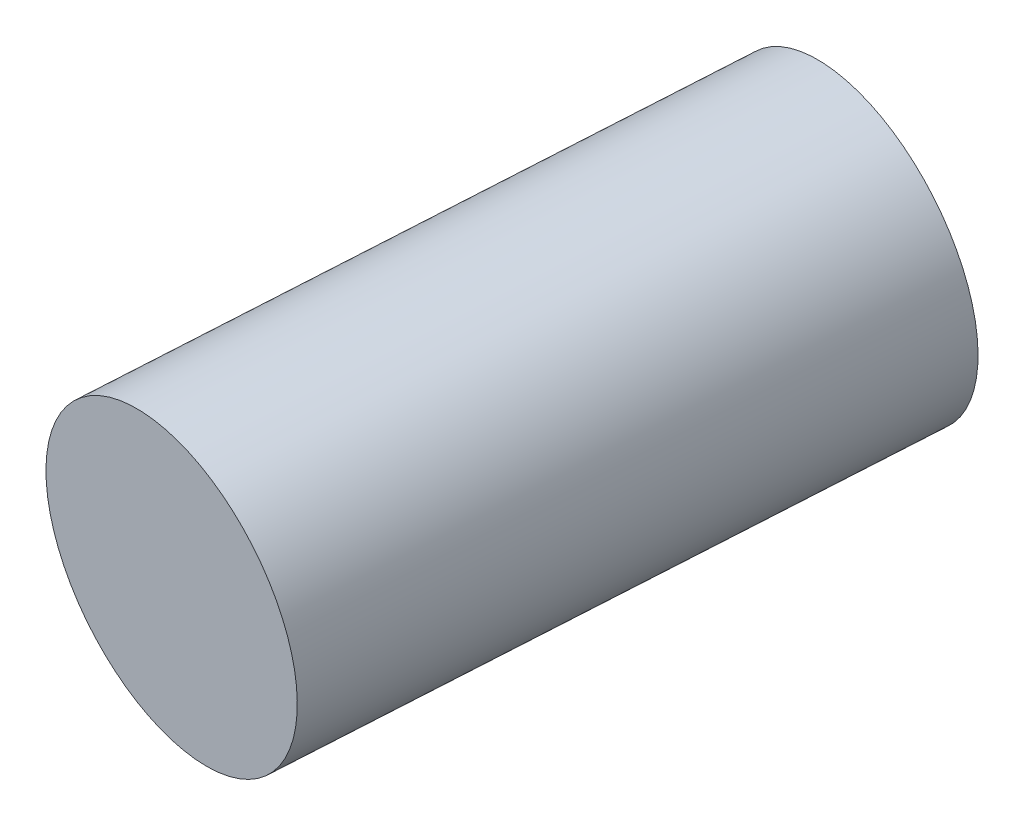
ISO-10303-21;
HEADER;
FILE_DESCRIPTION(('STEP AP214'),'2;1');
FILE_NAME('part.step','',(''),(''),'','','');
FILE_SCHEMA(('AUTOMOTIVE_DESIGN { 1 0 10303 214 1 1 1 1 }'));
ENDSEC;
DATA;
#1=APPLICATION_CONTEXT('core data for automotive mechanical design processes');
#2=APPLICATION_PROTOCOL_DEFINITION('international standard','automotive_design',2000,#1);
#3=PRODUCT_CONTEXT('',#1,'mechanical');
#4=PRODUCT('Part','Part','',(#3));
#5=PRODUCT_RELATED_PRODUCT_CATEGORY('part','',(#4));
#6=PRODUCT_DEFINITION_FORMATION('','',#4);
#7=PRODUCT_DEFINITION_CONTEXT('part definition',#1,'design');
#8=PRODUCT_DEFINITION('design','',#6,#7);
#9=PRODUCT_DEFINITION_SHAPE('','',#8);
#10=(LENGTH_UNIT() NAMED_UNIT(*) SI_UNIT(.MILLI.,.METRE.));
#11=(NAMED_UNIT(*) PLANE_ANGLE_UNIT() SI_UNIT($,.RADIAN.));
#12=(NAMED_UNIT(*) SI_UNIT($,.STERADIAN.) SOLID_ANGLE_UNIT());
#13=UNCERTAINTY_MEASURE_WITH_UNIT(LENGTH_MEASURE(1.E-05),#10,'distance_accuracy_value','');
#14=(GEOMETRIC_REPRESENTATION_CONTEXT(3) GLOBAL_UNCERTAINTY_ASSIGNED_CONTEXT((#13)) GLOBAL_UNIT_ASSIGNED_CONTEXT((#10,
#11,#12)) REPRESENTATION_CONTEXT('',''));
#15=CARTESIAN_POINT('',(0.,0.,0.));
#16=DIRECTION('',(0.,0.,1.));
#17=DIRECTION('',(1.,0.,0.));
#18=AXIS2_PLACEMENT_3D('',#15,#16,#17);
#19=CARTESIAN_POINT('',(9.46265533813226,5.46326660671928,5.55625000000001));
#20=DIRECTION('',(-0.150383733180433,-0.0868240888334634,0.984807753012209));
#21=DIRECTION('',(-0.852868531952445,-0.492403876506102,-0.173648177666927));
#22=AXIS2_PLACEMENT_3D('',#19,#20,#21);
#23=CYLINDRICAL_SURFACE('',#22,1.93220030269667);
#24=CARTESIAN_POINT('',(9.62646498755646,5.5578421519102,4.48352085995661));
#25=DIRECTION('',(-0.150383733180433,-0.0868240888334634,0.984807753012209));
#26=DIRECTION('',(-0.852868531952445,-0.492403876506102,-0.173648177666927));
#27=AXIS2_PLACEMENT_3D('',#24,#25,#26);
#28=CIRCLE('',#27,1.93220030269667);
#29=CARTESIAN_POINT('',(7.97855215195748,4.6064192326761,4.14799779850585));
#30=VERTEX_POINT('',#29);
#31=EDGE_CURVE('E22',#30,#30,#28,.T.);
#32=ORIENTED_EDGE('',*,*,#31,.F.);
#33=EDGE_LOOP('',(#32));
#34=FACE_BOUND('',#33,.T.);
#35=CARTESIAN_POINT('',(10.7959490356235,6.23304408187466,-3.175));
#36=DIRECTION('',(-0.150383733180433,-0.0868240888334634,0.984807753012209));
#37=DIRECTION('',(-0.852868531952445,-0.492403876506102,-0.173648177666927));
#38=AXIS2_PLACEMENT_3D('',#35,#36,#37);
#39=CIRCLE('',#38,1.93220030269668);
#40=CARTESIAN_POINT('',(9.14803620002451,5.28162116264055,-3.51052306145076));
#41=VERTEX_POINT('',#40);
#42=EDGE_CURVE('E10',#41,#41,#39,.T.);
#43=ORIENTED_EDGE('',*,*,#42,.T.);
#44=EDGE_LOOP('',(#43));
#45=FACE_BOUND('',#44,.T.);
#46=ADVANCED_FACE('F15',(#34,#45),#23,.T.);
#47=CARTESIAN_POINT('',(12.4438618712225,7.18446700110877,-2.83947693854923));
#48=DIRECTION('',(-0.150383733180433,-0.0868240888334633,0.984807753012209));
#49=DIRECTION('',(-0.852868531952445,-0.492403876506102,-0.173648177666927));
#50=AXIS2_PLACEMENT_3D('',#47,#48,#49);
#51=PLANE('',#50);
#52=ORIENTED_EDGE('',*,*,#42,.F.);
#53=EDGE_LOOP('',(#52));
#54=FACE_BOUND('',#53,.T.);
#55=ADVANCED_FACE('F30',(#54),#51,.F.);
#56=CARTESIAN_POINT('',(9.62646498755646,5.5578421519102,4.48352085995661));
#57=DIRECTION('',(0.150383733180433,0.0868240888334633,-0.984807753012209));
#58=DIRECTION('',(0.852868531952445,0.492403876506102,0.173648177666927));
#59=AXIS2_PLACEMENT_3D('',#56,#57,#58);
#60=PLANE('',#59);
#61=ORIENTED_EDGE('',*,*,#31,.T.);
#62=EDGE_LOOP('',(#61));
#63=FACE_BOUND('',#62,.T.);
#64=ADVANCED_FACE('F17',(#63),#60,.F.);
#65=CLOSED_SHELL('',(#46,#55,#64));
#66=MANIFOLD_SOLID_BREP('B1',#65);
#67=ADVANCED_BREP_SHAPE_REPRESENTATION('',(#18,#66),#14);
#68=SHAPE_DEFINITION_REPRESENTATION(#9,#67);
ENDSEC;
END-ISO-10303-21;
